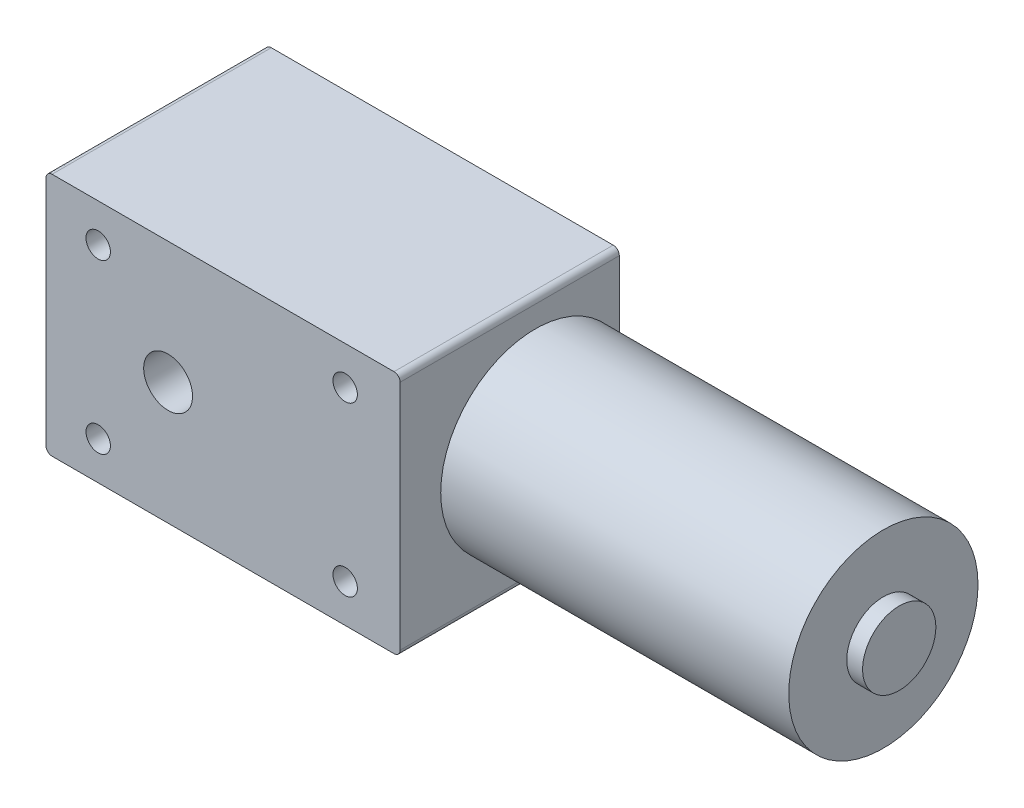
ISO-10303-21;
HEADER;
FILE_DESCRIPTION(('STEP AP214'),'2;1');
FILE_NAME('part.step','',(''),(''),'','','');
FILE_SCHEMA(('AUTOMOTIVE_DESIGN { 1 0 10303 214 1 1 1 1 }'));
ENDSEC;
DATA;
#1=APPLICATION_CONTEXT('core data for automotive mechanical design processes');
#2=APPLICATION_PROTOCOL_DEFINITION('international standard','automotive_design',2000,#1);
#3=PRODUCT_CONTEXT('',#1,'mechanical');
#4=PRODUCT('Part','Part','',(#3));
#5=PRODUCT_RELATED_PRODUCT_CATEGORY('part','',(#4));
#6=PRODUCT_DEFINITION_FORMATION('','',#4);
#7=PRODUCT_DEFINITION_CONTEXT('part definition',#1,'design');
#8=PRODUCT_DEFINITION('design','',#6,#7);
#9=PRODUCT_DEFINITION_SHAPE('','',#8);
#10=(LENGTH_UNIT() NAMED_UNIT(*) SI_UNIT(.MILLI.,.METRE.));
#11=(NAMED_UNIT(*) PLANE_ANGLE_UNIT() SI_UNIT($,.RADIAN.));
#12=(NAMED_UNIT(*) SI_UNIT($,.STERADIAN.) SOLID_ANGLE_UNIT());
#13=UNCERTAINTY_MEASURE_WITH_UNIT(LENGTH_MEASURE(1.E-05),#10,'distance_accuracy_value','');
#14=(GEOMETRIC_REPRESENTATION_CONTEXT(3) GLOBAL_UNCERTAINTY_ASSIGNED_CONTEXT((#13)) GLOBAL_UNIT_ASSIGNED_CONTEXT((#10,
#11,#12)) REPRESENTATION_CONTEXT('',''));
#15=CARTESIAN_POINT('',(0.,0.,0.));
#16=DIRECTION('',(0.,0.,1.));
#17=DIRECTION('',(1.,0.,0.));
#18=AXIS2_PLACEMENT_3D('',#15,#16,#17);
#19=CARTESIAN_POINT('',(57.,0.,0.));
#20=DIRECTION('',(-1.,0.,0.));
#21=DIRECTION('',(0.,0.,1.));
#22=AXIS2_PLACEMENT_3D('',#19,#20,#21);
#23=CYLINDRICAL_SURFACE('',#22,15.5);
#24=CARTESIAN_POINT('',(57.,0.,0.));
#25=DIRECTION('',(1.,0.,0.));
#26=DIRECTION('',(0.,0.,-1.));
#27=AXIS2_PLACEMENT_3D('',#24,#25,#26);
#28=CIRCLE('',#27,15.5);
#29=CARTESIAN_POINT('',(57.,0.,-15.5));
#30=VERTEX_POINT('',#29);
#31=EDGE_CURVE('E134',#30,#30,#28,.T.);
#32=ORIENTED_EDGE('',*,*,#31,.F.);
#33=EDGE_LOOP('',(#32));
#34=FACE_BOUND('',#33,.T.);
#35=CARTESIAN_POINT('',(0.,0.,0.));
#36=DIRECTION('',(1.,0.,0.));
#37=DIRECTION('',(0.,0.,-1.));
#38=AXIS2_PLACEMENT_3D('',#35,#36,#37);
#39=CIRCLE('',#38,15.5);
#40=CARTESIAN_POINT('',(0.,7.15454401062709,-13.75));
#41=VERTEX_POINT('',#40);
#42=CARTESIAN_POINT('',(0.,-7.15454401062709,-13.75));
#43=VERTEX_POINT('',#42);
#44=EDGE_CURVE('E114',#41,#43,#39,.T.);
#45=ORIENTED_EDGE('',*,*,#44,.T.);
#46=EDGE_CURVE('E129',#43,#41,#39,.T.);
#47=ORIENTED_EDGE('',*,*,#46,.T.);
#48=EDGE_LOOP('',(#45,#47));
#49=FACE_BOUND('',#48,.T.);
#50=ADVANCED_FACE('F36',(#34,#49),#23,.T.);
#51=CARTESIAN_POINT('',(57.,0.,0.));
#52=DIRECTION('',(1.,0.,0.));
#53=DIRECTION('',(0.,0.,-1.));
#54=AXIS2_PLACEMENT_3D('',#51,#52,#53);
#55=PLANE('',#54);
#56=CARTESIAN_POINT('',(57.,0.,0.));
#57=DIRECTION('',(1.,0.,0.));
#58=DIRECTION('',(0.,0.,-1.));
#59=AXIS2_PLACEMENT_3D('',#56,#57,#58);
#60=CIRCLE('',#59,6.);
#61=CARTESIAN_POINT('',(57.,0.,-6.));
#62=VERTEX_POINT('',#61);
#63=EDGE_CURVE('E128',#62,#62,#60,.T.);
#64=ORIENTED_EDGE('',*,*,#63,.F.);
#65=EDGE_LOOP('',(#64));
#66=FACE_BOUND('',#65,.T.);
#67=ORIENTED_EDGE('',*,*,#31,.T.);
#68=EDGE_LOOP('',(#67));
#69=FACE_BOUND('',#68,.T.);
#70=ADVANCED_FACE('F217',(#66,#69),#55,.T.);
#71=CARTESIAN_POINT('',(0.,0.,0.));
#72=DIRECTION('',(1.,0.,0.));
#73=DIRECTION('',(0.,0.,-1.));
#74=AXIS2_PLACEMENT_3D('',#71,#72,#73);
#75=PLANE('',#74);
#76=ORIENTED_EDGE('',*,*,#46,.F.);
#77=DIRECTION('',(0.,1.,0.));
#78=VECTOR('',#77,1.);
#79=CARTESIAN_POINT('',(0.,-20.,-13.75));
#80=LINE('',#79,#78);
#81=EDGE_CURVE('E122',#43,#41,#80,.T.);
#82=ORIENTED_EDGE('',*,*,#81,.T.);
#83=EDGE_LOOP('',(#76,#82));
#84=FACE_BOUND('',#83,.T.);
#85=ADVANCED_FACE('F130',(#84),#75,.F.);
#86=CARTESIAN_POINT('',(59.6,0.,0.));
#87=DIRECTION('',(-1.,0.,0.));
#88=DIRECTION('',(0.,0.,1.));
#89=AXIS2_PLACEMENT_3D('',#86,#87,#88);
#90=CYLINDRICAL_SURFACE('',#89,6.);
#91=CARTESIAN_POINT('',(59.6,0.,0.));
#92=DIRECTION('',(1.,0.,0.));
#93=DIRECTION('',(0.,0.,-1.));
#94=AXIS2_PLACEMENT_3D('',#91,#92,#93);
#95=CIRCLE('',#94,6.);
#96=CARTESIAN_POINT('',(59.6,0.,-6.));
#97=VERTEX_POINT('',#96);
#98=EDGE_CURVE('E132',#97,#97,#95,.T.);
#99=ORIENTED_EDGE('',*,*,#98,.F.);
#100=EDGE_LOOP('',(#99));
#101=FACE_BOUND('',#100,.T.);
#102=ORIENTED_EDGE('',*,*,#63,.T.);
#103=EDGE_LOOP('',(#102));
#104=FACE_BOUND('',#103,.T.);
#105=ADVANCED_FACE('F215',(#101,#104),#90,.T.);
#106=CARTESIAN_POINT('',(59.6,0.,0.));
#107=DIRECTION('',(1.,0.,0.));
#108=DIRECTION('',(0.,0.,-1.));
#109=AXIS2_PLACEMENT_3D('',#106,#107,#108);
#110=PLANE('',#109);
#111=ORIENTED_EDGE('',*,*,#98,.T.);
#112=EDGE_LOOP('',(#111));
#113=FACE_BOUND('',#112,.T.);
#114=ADVANCED_FACE('F260',(#113),#110,.T.);
#115=CARTESIAN_POINT('',(0.,-20.,-13.75));
#116=DIRECTION('',(1.,0.,0.));
#117=DIRECTION('',(0.,0.,-1.));
#118=AXIS2_PLACEMENT_3D('',#115,#116,#117);
#119=PLANE('',#118);
#120=DIRECTION('',(0.,1.,0.));
#121=VECTOR('',#120,1.);
#122=CARTESIAN_POINT('',(0.,-20.,22.15));
#123=LINE('',#122,#121);
#124=CARTESIAN_POINT('',(0.,-19.,22.15));
#125=VERTEX_POINT('',#124);
#126=CARTESIAN_POINT('',(0.,19.,22.15));
#127=VERTEX_POINT('',#126);
#128=EDGE_CURVE('E188',#125,#127,#123,.T.);
#129=ORIENTED_EDGE('',*,*,#128,.F.);
#130=DIRECTION('',(0.,0.,1.));
#131=VECTOR('',#130,1.);
#132=CARTESIAN_POINT('',(0.,-19.,-13.75));
#133=LINE('',#132,#131);
#134=CARTESIAN_POINT('',(0.,-19.,-13.75));
#135=VERTEX_POINT('',#134);
#136=EDGE_CURVE('E117',#125,#135,#133,.F.);
#137=ORIENTED_EDGE('',*,*,#136,.T.);
#138=EDGE_CURVE('E108',#135,#43,#80,.T.);
#139=ORIENTED_EDGE('',*,*,#138,.T.);
#140=ORIENTED_EDGE('',*,*,#44,.F.);
#141=CARTESIAN_POINT('',(0.,19.,-13.75));
#142=VERTEX_POINT('',#141);
#143=EDGE_CURVE('E120',#41,#142,#80,.T.);
#144=ORIENTED_EDGE('',*,*,#143,.T.);
#145=DIRECTION('',(0.,0.,1.));
#146=VECTOR('',#145,1.);
#147=CARTESIAN_POINT('',(0.,19.,-13.75));
#148=LINE('',#147,#146);
#149=EDGE_CURVE('E151',#142,#127,#148,.T.);
#150=ORIENTED_EDGE('',*,*,#149,.T.);
#151=EDGE_LOOP('',(#129,#137,#139,#140,#144,#150));
#152=FACE_BOUND('',#151,.T.);
#153=ADVANCED_FACE('F111',(#152),#119,.T.);
#154=CARTESIAN_POINT('',(-58.,-20.,-13.75));
#155=DIRECTION('',(0.,-1.,0.));
#156=DIRECTION('',(0.,0.,-1.));
#157=AXIS2_PLACEMENT_3D('',#154,#155,#156);
#158=PLANE('',#157);
#159=DIRECTION('',(1.,0.,0.));
#160=VECTOR('',#159,1.);
#161=CARTESIAN_POINT('',(-58.,-20.,-13.75));
#162=LINE('',#161,#160);
#163=CARTESIAN_POINT('',(-57.,-20.,-13.75));
#164=VERTEX_POINT('',#163);
#165=CARTESIAN_POINT('',(-1.00000000000001,-20.,-13.75));
#166=VERTEX_POINT('',#165);
#167=EDGE_CURVE('E208',#164,#166,#162,.T.);
#168=ORIENTED_EDGE('',*,*,#167,.T.);
#169=DIRECTION('',(0.,0.,1.));
#170=VECTOR('',#169,1.);
#171=CARTESIAN_POINT('',(-1.,-20.,-13.75));
#172=LINE('',#171,#170);
#173=CARTESIAN_POINT('',(-1.00000000000001,-20.,22.15));
#174=VERTEX_POINT('',#173);
#175=EDGE_CURVE('E140',#166,#174,#172,.T.);
#176=ORIENTED_EDGE('',*,*,#175,.T.);
#177=DIRECTION('',(1.,0.,0.));
#178=VECTOR('',#177,1.);
#179=CARTESIAN_POINT('',(-58.,-20.,22.15));
#180=LINE('',#179,#178);
#181=CARTESIAN_POINT('',(-57.,-20.,22.15));
#182=VERTEX_POINT('',#181);
#183=EDGE_CURVE('E183',#182,#174,#180,.T.);
#184=ORIENTED_EDGE('',*,*,#183,.F.);
#185=DIRECTION('',(0.,0.,1.));
#186=VECTOR('',#185,1.);
#187=CARTESIAN_POINT('',(-57.,-20.,-13.75));
#188=LINE('',#187,#186);
#189=EDGE_CURVE('E127',#182,#164,#188,.F.);
#190=ORIENTED_EDGE('',*,*,#189,.T.);
#191=EDGE_LOOP('',(#168,#176,#184,#190));
#192=FACE_BOUND('',#191,.T.);
#193=ADVANCED_FACE('F251',(#192),#158,.T.);
#194=CARTESIAN_POINT('',(-58.,-20.,-13.75));
#195=DIRECTION('',(-1.,0.,0.));
#196=DIRECTION('',(0.,0.,1.));
#197=AXIS2_PLACEMENT_3D('',#194,#195,#196);
#198=PLANE('',#197);
#199=DIRECTION('',(0.,-1.,0.));
#200=VECTOR('',#199,1.);
#201=CARTESIAN_POINT('',(-58.,-20.,-13.75));
#202=LINE('',#201,#200);
#203=CARTESIAN_POINT('',(-58.,19.,-13.75));
#204=VERTEX_POINT('',#203);
#205=CARTESIAN_POINT('',(-58.,-19.,-13.75));
#206=VERTEX_POINT('',#205);
#207=EDGE_CURVE('E174',#204,#206,#202,.T.);
#208=ORIENTED_EDGE('',*,*,#207,.T.);
#209=DIRECTION('',(0.,0.,1.));
#210=VECTOR('',#209,1.);
#211=CARTESIAN_POINT('',(-58.,-19.,-13.75));
#212=LINE('',#211,#210);
#213=CARTESIAN_POINT('',(-58.,-19.,22.15));
#214=VERTEX_POINT('',#213);
#215=EDGE_CURVE('E164',#206,#214,#212,.T.);
#216=ORIENTED_EDGE('',*,*,#215,.T.);
#217=DIRECTION('',(0.,-1.,0.));
#218=VECTOR('',#217,1.);
#219=CARTESIAN_POINT('',(-58.,-20.,22.15));
#220=LINE('',#219,#218);
#221=CARTESIAN_POINT('',(-58.,19.,22.15));
#222=VERTEX_POINT('',#221);
#223=EDGE_CURVE('E172',#222,#214,#220,.T.);
#224=ORIENTED_EDGE('',*,*,#223,.F.);
#225=DIRECTION('',(0.,0.,1.));
#226=VECTOR('',#225,1.);
#227=CARTESIAN_POINT('',(-58.,19.,-13.75));
#228=LINE('',#227,#226);
#229=EDGE_CURVE('E162',#222,#204,#228,.F.);
#230=ORIENTED_EDGE('',*,*,#229,.T.);
#231=EDGE_LOOP('',(#208,#216,#224,#230));
#232=FACE_BOUND('',#231,.T.);
#233=ADVANCED_FACE('F171',(#232),#198,.T.);
#234=CARTESIAN_POINT('',(-58.,20.,-13.75));
#235=DIRECTION('',(0.,1.,0.));
#236=DIRECTION('',(0.,0.,1.));
#237=AXIS2_PLACEMENT_3D('',#234,#235,#236);
#238=PLANE('',#237);
#239=DIRECTION('',(-1.,0.,0.));
#240=VECTOR('',#239,1.);
#241=CARTESIAN_POINT('',(-58.,20.,-13.75));
#242=LINE('',#241,#240);
#243=CARTESIAN_POINT('',(-1.00000000000001,20.,-13.75));
#244=VERTEX_POINT('',#243);
#245=CARTESIAN_POINT('',(-57.,20.,-13.75));
#246=VERTEX_POINT('',#245);
#247=EDGE_CURVE('E119',#244,#246,#242,.T.);
#248=ORIENTED_EDGE('',*,*,#247,.T.);
#249=DIRECTION('',(0.,0.,1.));
#250=VECTOR('',#249,1.);
#251=CARTESIAN_POINT('',(-57.,20.,-13.75));
#252=LINE('',#251,#250);
#253=CARTESIAN_POINT('',(-57.,20.,22.15));
#254=VERTEX_POINT('',#253);
#255=EDGE_CURVE('E11',#246,#254,#252,.T.);
#256=ORIENTED_EDGE('',*,*,#255,.T.);
#257=DIRECTION('',(-1.,0.,0.));
#258=VECTOR('',#257,1.);
#259=CARTESIAN_POINT('',(-58.,20.,22.15));
#260=LINE('',#259,#258);
#261=CARTESIAN_POINT('',(-1.00000000000001,20.,22.15));
#262=VERTEX_POINT('',#261);
#263=EDGE_CURVE('E184',#262,#254,#260,.T.);
#264=ORIENTED_EDGE('',*,*,#263,.F.);
#265=DIRECTION('',(0.,0.,1.));
#266=VECTOR('',#265,1.);
#267=CARTESIAN_POINT('',(-1.,20.,-13.75));
#268=LINE('',#267,#266);
#269=EDGE_CURVE('E44',#262,#244,#268,.F.);
#270=ORIENTED_EDGE('',*,*,#269,.T.);
#271=EDGE_LOOP('',(#248,#256,#264,#270));
#272=FACE_BOUND('',#271,.T.);
#273=ADVANCED_FACE('F243',(#272),#238,.T.);
#274=CARTESIAN_POINT('',(0.,0.,-13.75));
#275=DIRECTION('',(0.,0.,-1.));
#276=DIRECTION('',(-1.,0.,0.));
#277=AXIS2_PLACEMENT_3D('',#274,#275,#276);
#278=PLANE('',#277);
#279=CARTESIAN_POINT('',(-9.,-13.75,-13.75));
#280=DIRECTION('',(0.,0.,1.));
#281=DIRECTION('',(1.,0.,0.));
#282=AXIS2_PLACEMENT_3D('',#279,#280,#281);
#283=CIRCLE('',#282,2.);
#284=CARTESIAN_POINT('',(-7.,-13.75,-13.75));
#285=VERTEX_POINT('',#284);
#286=EDGE_CURVE('E186',#285,#285,#283,.T.);
#287=ORIENTED_EDGE('',*,*,#286,.T.);
#288=EDGE_LOOP('',(#287));
#289=FACE_BOUND('',#288,.T.);
#290=CARTESIAN_POINT('',(-49.45,-13.7500000000003,-13.75));
#291=DIRECTION('',(0.,0.,1.));
#292=DIRECTION('',(1.,0.,0.));
#293=AXIS2_PLACEMENT_3D('',#290,#291,#292);
#294=CIRCLE('',#293,2.);
#295=CARTESIAN_POINT('',(-47.45,-13.7500000000003,-13.75));
#296=VERTEX_POINT('',#295);
#297=EDGE_CURVE('E194',#296,#296,#294,.T.);
#298=ORIENTED_EDGE('',*,*,#297,.T.);
#299=EDGE_LOOP('',(#298));
#300=FACE_BOUND('',#299,.T.);
#301=CARTESIAN_POINT('',(-49.45,13.7499999999997,-13.75));
#302=DIRECTION('',(0.,0.,1.));
#303=DIRECTION('',(1.,0.,0.));
#304=AXIS2_PLACEMENT_3D('',#301,#302,#303);
#305=CIRCLE('',#304,2.);
#306=CARTESIAN_POINT('',(-47.45,13.7499999999997,-13.75));
#307=VERTEX_POINT('',#306);
#308=EDGE_CURVE('E197',#307,#307,#305,.T.);
#309=ORIENTED_EDGE('',*,*,#308,.T.);
#310=EDGE_LOOP('',(#309));
#311=FACE_BOUND('',#310,.T.);
#312=CARTESIAN_POINT('',(-38.,0.,-13.75));
#313=DIRECTION('',(0.,0.,1.));
#314=DIRECTION('',(1.,0.,0.));
#315=AXIS2_PLACEMENT_3D('',#312,#313,#314);
#316=CIRCLE('',#315,4.00000000000001);
#317=CARTESIAN_POINT('',(-34.,0.,-13.75));
#318=VERTEX_POINT('',#317);
#319=EDGE_CURVE('E200',#318,#318,#316,.T.);
#320=ORIENTED_EDGE('',*,*,#319,.T.);
#321=EDGE_LOOP('',(#320));
#322=FACE_BOUND('',#321,.T.);
#323=CARTESIAN_POINT('',(-9.,13.75,-13.75));
#324=DIRECTION('',(0.,0.,1.));
#325=DIRECTION('',(1.,0.,0.));
#326=AXIS2_PLACEMENT_3D('',#323,#324,#325);
#327=CIRCLE('',#326,2.);
#328=CARTESIAN_POINT('',(-7.,13.75,-13.75));
#329=VERTEX_POINT('',#328);
#330=EDGE_CURVE('E203',#329,#329,#327,.T.);
#331=ORIENTED_EDGE('',*,*,#330,.T.);
#332=EDGE_LOOP('',(#331));
#333=FACE_BOUND('',#332,.T.);
#334=ORIENTED_EDGE('',*,*,#138,.F.);
#335=CARTESIAN_POINT('',(-1.,-19.,-13.75));
#336=DIRECTION('',(0.,0.,-1.));
#337=DIRECTION('',(-1.,0.,0.));
#338=AXIS2_PLACEMENT_3D('',#335,#336,#337);
#339=CIRCLE('',#338,1.);
#340=EDGE_CURVE('E160',#135,#166,#339,.T.);
#341=ORIENTED_EDGE('',*,*,#340,.T.);
#342=ORIENTED_EDGE('',*,*,#167,.F.);
#343=CARTESIAN_POINT('',(-57.,-19.,-13.75));
#344=DIRECTION('',(0.,0.,-1.));
#345=DIRECTION('',(-1.,0.,0.));
#346=AXIS2_PLACEMENT_3D('',#343,#344,#345);
#347=CIRCLE('',#346,1.);
#348=EDGE_CURVE('E158',#164,#206,#347,.T.);
#349=ORIENTED_EDGE('',*,*,#348,.T.);
#350=ORIENTED_EDGE('',*,*,#207,.F.);
#351=CARTESIAN_POINT('',(-57.,19.,-13.75));
#352=DIRECTION('',(0.,0.,-1.));
#353=DIRECTION('',(-1.,0.,0.));
#354=AXIS2_PLACEMENT_3D('',#351,#352,#353);
#355=CIRCLE('',#354,1.);
#356=EDGE_CURVE('E51',#204,#246,#355,.T.);
#357=ORIENTED_EDGE('',*,*,#356,.T.);
#358=ORIENTED_EDGE('',*,*,#247,.F.);
#359=CARTESIAN_POINT('',(-1.,19.,-13.75));
#360=DIRECTION('',(0.,0.,-1.));
#361=DIRECTION('',(-1.,0.,0.));
#362=AXIS2_PLACEMENT_3D('',#359,#360,#361);
#363=CIRCLE('',#362,1.);
#364=EDGE_CURVE('E155',#244,#142,#363,.T.);
#365=ORIENTED_EDGE('',*,*,#364,.T.);
#366=ORIENTED_EDGE('',*,*,#143,.F.);
#367=ORIENTED_EDGE('',*,*,#81,.F.);
#368=EDGE_LOOP('',(#334,#341,#342,#349,#350,#357,#358,#365,#366,#367));
#369=FACE_BOUND('',#368,.T.);
#370=ADVANCED_FACE('F124',(#289,#300,#311,#322,#333,#369),#278,.T.);
#371=CARTESIAN_POINT('',(-9.,13.75,-13.75));
#372=DIRECTION('',(0.,0.,1.));
#373=DIRECTION('',(1.,0.,0.));
#374=AXIS2_PLACEMENT_3D('',#371,#372,#373);
#375=CYLINDRICAL_SURFACE('',#374,2.);
#376=ORIENTED_EDGE('',*,*,#330,.F.);
#377=EDGE_LOOP('',(#376));
#378=FACE_BOUND('',#377,.T.);
#379=CARTESIAN_POINT('',(-9.,13.75,22.15));
#380=DIRECTION('',(0.,0.,1.));
#381=DIRECTION('',(1.,0.,0.));
#382=AXIS2_PLACEMENT_3D('',#379,#380,#381);
#383=CIRCLE('',#382,2.);
#384=CARTESIAN_POINT('',(-7.,13.75,22.15));
#385=VERTEX_POINT('',#384);
#386=EDGE_CURVE('E247',#385,#385,#383,.T.);
#387=ORIENTED_EDGE('',*,*,#386,.T.);
#388=EDGE_LOOP('',(#387));
#389=FACE_BOUND('',#388,.T.);
#390=ADVANCED_FACE('F334',(#378,#389),#375,.F.);
#391=CARTESIAN_POINT('',(-38.,0.,-13.75));
#392=DIRECTION('',(0.,0.,1.));
#393=DIRECTION('',(1.,0.,0.));
#394=AXIS2_PLACEMENT_3D('',#391,#392,#393);
#395=CYLINDRICAL_SURFACE('',#394,4.00000000000001);
#396=ORIENTED_EDGE('',*,*,#319,.F.);
#397=EDGE_LOOP('',(#396));
#398=FACE_BOUND('',#397,.T.);
#399=CARTESIAN_POINT('',(-38.,0.,22.15));
#400=DIRECTION('',(0.,0.,1.));
#401=DIRECTION('',(1.,0.,0.));
#402=AXIS2_PLACEMENT_3D('',#399,#400,#401);
#403=CIRCLE('',#402,4.00000000000001);
#404=CARTESIAN_POINT('',(-34.,0.,22.15));
#405=VERTEX_POINT('',#404);
#406=EDGE_CURVE('E413',#405,#405,#403,.T.);
#407=ORIENTED_EDGE('',*,*,#406,.T.);
#408=EDGE_LOOP('',(#407));
#409=FACE_BOUND('',#408,.T.);
#410=ADVANCED_FACE('F385',(#398,#409),#395,.F.);
#411=CARTESIAN_POINT('',(-49.45,13.7499999999997,-13.75));
#412=DIRECTION('',(0.,0.,1.));
#413=DIRECTION('',(1.,0.,0.));
#414=AXIS2_PLACEMENT_3D('',#411,#412,#413);
#415=CYLINDRICAL_SURFACE('',#414,2.);
#416=ORIENTED_EDGE('',*,*,#308,.F.);
#417=EDGE_LOOP('',(#416));
#418=FACE_BOUND('',#417,.T.);
#419=CARTESIAN_POINT('',(-49.45,13.7499999999997,22.15));
#420=DIRECTION('',(0.,0.,1.));
#421=DIRECTION('',(1.,0.,0.));
#422=AXIS2_PLACEMENT_3D('',#419,#420,#421);
#423=CIRCLE('',#422,2.);
#424=CARTESIAN_POINT('',(-47.45,13.7499999999997,22.15));
#425=VERTEX_POINT('',#424);
#426=EDGE_CURVE('E416',#425,#425,#423,.T.);
#427=ORIENTED_EDGE('',*,*,#426,.T.);
#428=EDGE_LOOP('',(#427));
#429=FACE_BOUND('',#428,.T.);
#430=ADVANCED_FACE('F377',(#418,#429),#415,.F.);
#431=CARTESIAN_POINT('',(-49.45,-13.7500000000003,-13.75));
#432=DIRECTION('',(0.,0.,1.));
#433=DIRECTION('',(1.,0.,0.));
#434=AXIS2_PLACEMENT_3D('',#431,#432,#433);
#435=CYLINDRICAL_SURFACE('',#434,2.);
#436=ORIENTED_EDGE('',*,*,#297,.F.);
#437=EDGE_LOOP('',(#436));
#438=FACE_BOUND('',#437,.T.);
#439=CARTESIAN_POINT('',(-49.45,-13.7500000000003,22.15));
#440=DIRECTION('',(0.,0.,1.));
#441=DIRECTION('',(1.,0.,0.));
#442=AXIS2_PLACEMENT_3D('',#439,#440,#441);
#443=CIRCLE('',#442,2.);
#444=CARTESIAN_POINT('',(-47.45,-13.7500000000003,22.15));
#445=VERTEX_POINT('',#444);
#446=EDGE_CURVE('E421',#445,#445,#443,.T.);
#447=ORIENTED_EDGE('',*,*,#446,.T.);
#448=EDGE_LOOP('',(#447));
#449=FACE_BOUND('',#448,.T.);
#450=ADVANCED_FACE('F372',(#438,#449),#435,.F.);
#451=CARTESIAN_POINT('',(-9.,-13.75,-13.75));
#452=DIRECTION('',(0.,0.,1.));
#453=DIRECTION('',(1.,0.,0.));
#454=AXIS2_PLACEMENT_3D('',#451,#452,#453);
#455=CYLINDRICAL_SURFACE('',#454,2.);
#456=ORIENTED_EDGE('',*,*,#286,.F.);
#457=EDGE_LOOP('',(#456));
#458=FACE_BOUND('',#457,.T.);
#459=CARTESIAN_POINT('',(-9.,-13.75,22.15));
#460=DIRECTION('',(0.,0.,1.));
#461=DIRECTION('',(1.,0.,0.));
#462=AXIS2_PLACEMENT_3D('',#459,#460,#461);
#463=CIRCLE('',#462,2.);
#464=CARTESIAN_POINT('',(-7.,-13.75,22.15));
#465=VERTEX_POINT('',#464);
#466=EDGE_CURVE('E424',#465,#465,#463,.T.);
#467=ORIENTED_EDGE('',*,*,#466,.T.);
#468=EDGE_LOOP('',(#467));
#469=FACE_BOUND('',#468,.T.);
#470=ADVANCED_FACE('F309',(#458,#469),#455,.F.);
#471=CARTESIAN_POINT('',(0.,0.,22.15));
#472=DIRECTION('',(0.,0.,-1.));
#473=DIRECTION('',(-1.,0.,0.));
#474=AXIS2_PLACEMENT_3D('',#471,#472,#473);
#475=PLANE('',#474);
#476=ORIENTED_EDGE('',*,*,#183,.T.);
#477=CARTESIAN_POINT('',(-1.,-19.,22.15));
#478=DIRECTION('',(0.,0.,-1.));
#479=DIRECTION('',(-1.,0.,0.));
#480=AXIS2_PLACEMENT_3D('',#477,#478,#479);
#481=CIRCLE('',#480,1.);
#482=EDGE_CURVE('E149',#174,#125,#481,.F.);
#483=ORIENTED_EDGE('',*,*,#482,.T.);
#484=ORIENTED_EDGE('',*,*,#128,.T.);
#485=CARTESIAN_POINT('',(-1.,19.,22.15));
#486=DIRECTION('',(0.,0.,-1.));
#487=DIRECTION('',(-1.,0.,0.));
#488=AXIS2_PLACEMENT_3D('',#485,#486,#487);
#489=CIRCLE('',#488,1.);
#490=EDGE_CURVE('E143',#127,#262,#489,.F.);
#491=ORIENTED_EDGE('',*,*,#490,.T.);
#492=ORIENTED_EDGE('',*,*,#263,.T.);
#493=CARTESIAN_POINT('',(-57.,19.,22.15));
#494=DIRECTION('',(0.,0.,-1.));
#495=DIRECTION('',(-1.,0.,0.));
#496=AXIS2_PLACEMENT_3D('',#493,#494,#495);
#497=CIRCLE('',#496,1.);
#498=EDGE_CURVE('E145',#254,#222,#497,.F.);
#499=ORIENTED_EDGE('',*,*,#498,.T.);
#500=ORIENTED_EDGE('',*,*,#223,.T.);
#501=CARTESIAN_POINT('',(-57.,-19.,22.15));
#502=DIRECTION('',(0.,0.,-1.));
#503=DIRECTION('',(-1.,0.,0.));
#504=AXIS2_PLACEMENT_3D('',#501,#502,#503);
#505=CIRCLE('',#504,1.);
#506=EDGE_CURVE('E147',#214,#182,#505,.F.);
#507=ORIENTED_EDGE('',*,*,#506,.T.);
#508=EDGE_LOOP('',(#476,#483,#484,#491,#492,#499,#500,#507));
#509=FACE_BOUND('',#508,.T.);
#510=ORIENTED_EDGE('',*,*,#386,.F.);
#511=EDGE_LOOP('',(#510));
#512=FACE_BOUND('',#511,.T.);
#513=ORIENTED_EDGE('',*,*,#406,.F.);
#514=EDGE_LOOP('',(#513));
#515=FACE_BOUND('',#514,.T.);
#516=ORIENTED_EDGE('',*,*,#426,.F.);
#517=EDGE_LOOP('',(#516));
#518=FACE_BOUND('',#517,.T.);
#519=ORIENTED_EDGE('',*,*,#446,.F.);
#520=EDGE_LOOP('',(#519));
#521=FACE_BOUND('',#520,.T.);
#522=ORIENTED_EDGE('',*,*,#466,.F.);
#523=EDGE_LOOP('',(#522));
#524=FACE_BOUND('',#523,.T.);
#525=ADVANCED_FACE('F179',(#509,#512,#515,#518,#521,#524),#475,.F.);
#526=CARTESIAN_POINT('',(-1.,-19.,-13.75));
#527=DIRECTION('',(0.,0.,1.));
#528=DIRECTION('',(1.,0.,0.));
#529=AXIS2_PLACEMENT_3D('',#526,#527,#528);
#530=CYLINDRICAL_SURFACE('',#529,1.);
#531=ORIENTED_EDGE('',*,*,#340,.F.);
#532=ORIENTED_EDGE('',*,*,#136,.F.);
#533=ORIENTED_EDGE('',*,*,#482,.F.);
#534=ORIENTED_EDGE('',*,*,#175,.F.);
#535=EDGE_LOOP('',(#531,#532,#533,#534));
#536=FACE_BOUND('',#535,.T.);
#537=ADVANCED_FACE('F229',(#536),#530,.T.);
#538=CARTESIAN_POINT('',(-57.,-19.,-13.75));
#539=DIRECTION('',(0.,0.,1.));
#540=DIRECTION('',(1.,0.,0.));
#541=AXIS2_PLACEMENT_3D('',#538,#539,#540);
#542=CYLINDRICAL_SURFACE('',#541,1.);
#543=ORIENTED_EDGE('',*,*,#348,.F.);
#544=ORIENTED_EDGE('',*,*,#189,.F.);
#545=ORIENTED_EDGE('',*,*,#506,.F.);
#546=ORIENTED_EDGE('',*,*,#215,.F.);
#547=EDGE_LOOP('',(#543,#544,#545,#546));
#548=FACE_BOUND('',#547,.T.);
#549=ADVANCED_FACE('F232',(#548),#542,.T.);
#550=CARTESIAN_POINT('',(-57.,19.,-13.75));
#551=DIRECTION('',(0.,0.,1.));
#552=DIRECTION('',(1.,0.,0.));
#553=AXIS2_PLACEMENT_3D('',#550,#551,#552);
#554=CYLINDRICAL_SURFACE('',#553,1.);
#555=ORIENTED_EDGE('',*,*,#356,.F.);
#556=ORIENTED_EDGE('',*,*,#229,.F.);
#557=ORIENTED_EDGE('',*,*,#498,.F.);
#558=ORIENTED_EDGE('',*,*,#255,.F.);
#559=EDGE_LOOP('',(#555,#556,#557,#558));
#560=FACE_BOUND('',#559,.T.);
#561=ADVANCED_FACE('F235',(#560),#554,.T.);
#562=CARTESIAN_POINT('',(-1.,19.,-13.75));
#563=DIRECTION('',(0.,0.,1.));
#564=DIRECTION('',(1.,0.,0.));
#565=AXIS2_PLACEMENT_3D('',#562,#563,#564);
#566=CYLINDRICAL_SURFACE('',#565,1.);
#567=ORIENTED_EDGE('',*,*,#364,.F.);
#568=ORIENTED_EDGE('',*,*,#269,.F.);
#569=ORIENTED_EDGE('',*,*,#490,.F.);
#570=ORIENTED_EDGE('',*,*,#149,.F.);
#571=EDGE_LOOP('',(#567,#568,#569,#570));
#572=FACE_BOUND('',#571,.T.);
#573=ADVANCED_FACE('F38',(#572),#566,.T.);
#574=CLOSED_SHELL('',(#50,#70,#85,#105,#114,#153,#193,#233,#273,#370,#390,#410,#430,#450,#470,
#525,#537,#549,#561,#573));
#575=MANIFOLD_SOLID_BREP('B2',#574);
#576=ADVANCED_BREP_SHAPE_REPRESENTATION('',(#18,#575),#14);
#577=SHAPE_DEFINITION_REPRESENTATION(#9,#576);
ENDSEC;
END-ISO-10303-21;
